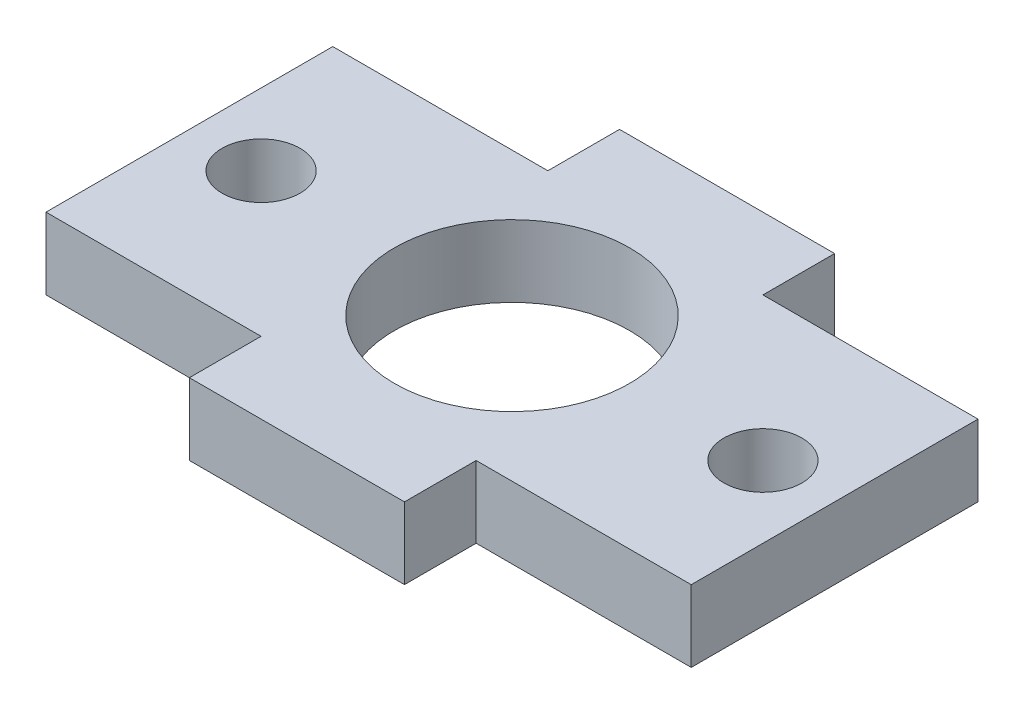
ISO-10303-21;
HEADER;
FILE_DESCRIPTION(('STEP AP214'),'2;1');
FILE_NAME('part.step','',(''),(''),'','','');
FILE_SCHEMA(('AUTOMOTIVE_DESIGN { 1 0 10303 214 1 1 1 1 }'));
ENDSEC;
DATA;
#1=APPLICATION_CONTEXT('core data for automotive mechanical design processes');
#2=APPLICATION_PROTOCOL_DEFINITION('international standard','automotive_design',2000,#1);
#3=PRODUCT_CONTEXT('',#1,'mechanical');
#4=PRODUCT('Part','Part','',(#3));
#5=PRODUCT_RELATED_PRODUCT_CATEGORY('part','',(#4));
#6=PRODUCT_DEFINITION_FORMATION('','',#4);
#7=PRODUCT_DEFINITION_CONTEXT('part definition',#1,'design');
#8=PRODUCT_DEFINITION('design','',#6,#7);
#9=PRODUCT_DEFINITION_SHAPE('','',#8);
#10=(LENGTH_UNIT() NAMED_UNIT(*) SI_UNIT(.MILLI.,.METRE.));
#11=(NAMED_UNIT(*) PLANE_ANGLE_UNIT() SI_UNIT($,.RADIAN.));
#12=(NAMED_UNIT(*) SI_UNIT($,.STERADIAN.) SOLID_ANGLE_UNIT());
#13=UNCERTAINTY_MEASURE_WITH_UNIT(LENGTH_MEASURE(1.E-05),#10,'distance_accuracy_value','');
#14=(GEOMETRIC_REPRESENTATION_CONTEXT(3) GLOBAL_UNCERTAINTY_ASSIGNED_CONTEXT((#13)) GLOBAL_UNIT_ASSIGNED_CONTEXT((#10,
#11,#12)) REPRESENTATION_CONTEXT('',''));
#15=CARTESIAN_POINT('',(0.,0.,0.));
#16=DIRECTION('',(0.,0.,1.));
#17=DIRECTION('',(1.,0.,0.));
#18=AXIS2_PLACEMENT_3D('',#15,#16,#17);
#19=CARTESIAN_POINT('',(-28.575,6.35,12.7));
#20=DIRECTION('',(0.,0.,-1.));
#21=DIRECTION('',(-1.,0.,0.));
#22=AXIS2_PLACEMENT_3D('',#19,#20,#21);
#23=PLANE('',#22);
#24=DIRECTION('',(0.,1.,0.));
#25=VECTOR('',#24,1.);
#26=CARTESIAN_POINT('',(9.525,-20.0804631420692,12.7));
#27=LINE('',#26,#25);
#28=CARTESIAN_POINT('',(9.525,0.,12.7));
#29=VERTEX_POINT('',#28);
#30=CARTESIAN_POINT('',(9.525,6.35,12.7));
#31=VERTEX_POINT('',#30);
#32=EDGE_CURVE('E161',#29,#31,#27,.T.);
#33=ORIENTED_EDGE('',*,*,#32,.F.);
#34=DIRECTION('',(1.,0.,0.));
#35=VECTOR('',#34,1.);
#36=CARTESIAN_POINT('',(-28.575,0.,12.7));
#37=LINE('',#36,#35);
#38=CARTESIAN_POINT('',(28.575,0.,12.7));
#39=VERTEX_POINT('',#38);
#40=EDGE_CURVE('E199',#29,#39,#37,.T.);
#41=ORIENTED_EDGE('',*,*,#40,.T.);
#42=DIRECTION('',(0.,-1.,0.));
#43=VECTOR('',#42,1.);
#44=CARTESIAN_POINT('',(28.575,6.35,12.7));
#45=LINE('',#44,#43);
#46=CARTESIAN_POINT('',(28.575,6.35,12.7));
#47=VERTEX_POINT('',#46);
#48=EDGE_CURVE('E181',#47,#39,#45,.T.);
#49=ORIENTED_EDGE('',*,*,#48,.F.);
#50=DIRECTION('',(1.,0.,0.));
#51=VECTOR('',#50,1.);
#52=CARTESIAN_POINT('',(-28.575,6.35,12.7));
#53=LINE('',#52,#51);
#54=EDGE_CURVE('E152',#31,#47,#53,.T.);
#55=ORIENTED_EDGE('',*,*,#54,.F.);
#56=EDGE_LOOP('',(#33,#41,#49,#55));
#57=FACE_BOUND('',#56,.T.);
#58=ADVANCED_FACE('F35',(#57),#23,.F.);
#59=CARTESIAN_POINT('',(-28.575,6.35,-12.7));
#60=DIRECTION('',(0.,0.,1.));
#61=DIRECTION('',(1.,0.,0.));
#62=AXIS2_PLACEMENT_3D('',#59,#60,#61);
#63=PLANE('',#62);
#64=DIRECTION('',(0.,1.,0.));
#65=VECTOR('',#64,1.);
#66=CARTESIAN_POINT('',(-9.525,-20.0804631420692,-12.7));
#67=LINE('',#66,#65);
#68=CARTESIAN_POINT('',(-9.525,0.,-12.7));
#69=VERTEX_POINT('',#68);
#70=CARTESIAN_POINT('',(-9.525,6.35,-12.7));
#71=VERTEX_POINT('',#70);
#72=EDGE_CURVE('E223',#69,#71,#67,.T.);
#73=ORIENTED_EDGE('',*,*,#72,.F.);
#74=DIRECTION('',(-1.,0.,0.));
#75=VECTOR('',#74,1.);
#76=CARTESIAN_POINT('',(-28.575,0.,-12.7));
#77=LINE('',#76,#75);
#78=CARTESIAN_POINT('',(-28.575,0.,-12.7));
#79=VERTEX_POINT('',#78);
#80=EDGE_CURVE('E217',#69,#79,#77,.T.);
#81=ORIENTED_EDGE('',*,*,#80,.T.);
#82=DIRECTION('',(0.,-1.,0.));
#83=VECTOR('',#82,1.);
#84=CARTESIAN_POINT('',(-28.575,6.35,-12.7));
#85=LINE('',#84,#83);
#86=CARTESIAN_POINT('',(-28.575,6.35,-12.7));
#87=VERTEX_POINT('',#86);
#88=EDGE_CURVE('E44',#87,#79,#85,.T.);
#89=ORIENTED_EDGE('',*,*,#88,.F.);
#90=DIRECTION('',(-1.,0.,0.));
#91=VECTOR('',#90,1.);
#92=CARTESIAN_POINT('',(-28.575,6.35,-12.7));
#93=LINE('',#92,#91);
#94=EDGE_CURVE('E188',#71,#87,#93,.T.);
#95=ORIENTED_EDGE('',*,*,#94,.F.);
#96=EDGE_LOOP('',(#73,#81,#89,#95));
#97=FACE_BOUND('',#96,.T.);
#98=ADVANCED_FACE('F302',(#97),#63,.F.);
#99=CARTESIAN_POINT('',(0.,6.35,0.));
#100=DIRECTION('',(0.,1.,0.));
#101=DIRECTION('',(0.,0.,1.));
#102=AXIS2_PLACEMENT_3D('',#99,#100,#101);
#103=PLANE('',#102);
#104=CARTESIAN_POINT('',(-22.225,6.35,0.));
#105=DIRECTION('',(0.,1.,0.));
#106=DIRECTION('',(0.,0.,1.));
#107=AXIS2_PLACEMENT_3D('',#104,#105,#106);
#108=CIRCLE('',#107,3.45440000000001);
#109=CARTESIAN_POINT('',(-22.225,6.35,3.45440000000001));
#110=VERTEX_POINT('',#109);
#111=EDGE_CURVE('E243',#110,#110,#108,.T.);
#112=ORIENTED_EDGE('',*,*,#111,.F.);
#113=EDGE_LOOP('',(#112));
#114=FACE_BOUND('',#113,.T.);
#115=DIRECTION('',(0.,0.,-1.));
#116=VECTOR('',#115,1.);
#117=CARTESIAN_POINT('',(28.575,6.35,-12.7));
#118=LINE('',#117,#116);
#119=CARTESIAN_POINT('',(28.575,6.35,-12.7));
#120=VERTEX_POINT('',#119);
#121=EDGE_CURVE('E222',#47,#120,#118,.T.);
#122=ORIENTED_EDGE('',*,*,#121,.T.);
#123=CARTESIAN_POINT('',(9.525,6.35,-12.7));
#124=VERTEX_POINT('',#123);
#125=EDGE_CURVE('E184',#120,#124,#93,.T.);
#126=ORIENTED_EDGE('',*,*,#125,.T.);
#127=DIRECTION('',(0.,0.,-1.));
#128=VECTOR('',#127,1.);
#129=CARTESIAN_POINT('',(9.525,6.35,-12.7));
#130=LINE('',#129,#128);
#131=CARTESIAN_POINT('',(9.525,6.35,-19.05));
#132=VERTEX_POINT('',#131);
#133=EDGE_CURVE('E265',#124,#132,#130,.T.);
#134=ORIENTED_EDGE('',*,*,#133,.T.);
#135=DIRECTION('',(-1.,0.,0.));
#136=VECTOR('',#135,1.);
#137=CARTESIAN_POINT('',(-9.525,6.35,-19.05));
#138=LINE('',#137,#136);
#139=CARTESIAN_POINT('',(-9.525,6.35,-19.05));
#140=VERTEX_POINT('',#139);
#141=EDGE_CURVE('E227',#132,#140,#138,.T.);
#142=ORIENTED_EDGE('',*,*,#141,.T.);
#143=DIRECTION('',(0.,0.,1.));
#144=VECTOR('',#143,1.);
#145=CARTESIAN_POINT('',(-9.525,6.35,-12.7));
#146=LINE('',#145,#144);
#147=EDGE_CURVE('E228',#140,#71,#146,.T.);
#148=ORIENTED_EDGE('',*,*,#147,.T.);
#149=ORIENTED_EDGE('',*,*,#94,.T.);
#150=DIRECTION('',(0.,0.,1.));
#151=VECTOR('',#150,1.);
#152=CARTESIAN_POINT('',(-28.575,6.35,-12.7));
#153=LINE('',#152,#151);
#154=CARTESIAN_POINT('',(-28.575,6.35,12.7));
#155=VERTEX_POINT('',#154);
#156=EDGE_CURVE('E183',#87,#155,#153,.T.);
#157=ORIENTED_EDGE('',*,*,#156,.T.);
#158=CARTESIAN_POINT('',(-9.525,6.35,12.7));
#159=VERTEX_POINT('',#158);
#160=EDGE_CURVE('E148',#155,#159,#53,.T.);
#161=ORIENTED_EDGE('',*,*,#160,.T.);
#162=DIRECTION('',(0.,0.,-1.));
#163=VECTOR('',#162,1.);
#164=CARTESIAN_POINT('',(-9.525,6.35,12.7));
#165=LINE('',#164,#163);
#166=CARTESIAN_POINT('',(-9.525,6.35,19.05));
#167=VERTEX_POINT('',#166);
#168=EDGE_CURVE('E52',#167,#159,#165,.T.);
#169=ORIENTED_EDGE('',*,*,#168,.F.);
#170=DIRECTION('',(-1.,0.,0.));
#171=VECTOR('',#170,1.);
#172=CARTESIAN_POINT('',(-9.525,6.35,19.05));
#173=LINE('',#172,#171);
#174=CARTESIAN_POINT('',(9.525,6.35,19.05));
#175=VERTEX_POINT('',#174);
#176=EDGE_CURVE('E136',#175,#167,#173,.T.);
#177=ORIENTED_EDGE('',*,*,#176,.F.);
#178=DIRECTION('',(0.,0.,1.));
#179=VECTOR('',#178,1.);
#180=CARTESIAN_POINT('',(9.525,6.35,12.7));
#181=LINE('',#180,#179);
#182=EDGE_CURVE('E133',#31,#175,#181,.T.);
#183=ORIENTED_EDGE('',*,*,#182,.F.);
#184=ORIENTED_EDGE('',*,*,#54,.T.);
#185=EDGE_LOOP('',(#122,#126,#134,#142,#148,#149,#157,#161,#169,#177,#183,#184));
#186=FACE_BOUND('',#185,.T.);
#187=CARTESIAN_POINT('',(0.,6.35,0.));
#188=DIRECTION('',(0.,1.,0.));
#189=DIRECTION('',(0.,0.,1.));
#190=AXIS2_PLACEMENT_3D('',#187,#188,#189);
#191=CIRCLE('',#190,10.414);
#192=CARTESIAN_POINT('',(0.,6.35,10.414));
#193=VERTEX_POINT('',#192);
#194=EDGE_CURVE('E249',#193,#193,#191,.T.);
#195=ORIENTED_EDGE('',*,*,#194,.F.);
#196=EDGE_LOOP('',(#195));
#197=FACE_BOUND('',#196,.T.);
#198=CARTESIAN_POINT('',(22.225,6.35,0.));
#199=DIRECTION('',(0.,1.,0.));
#200=DIRECTION('',(0.,0.,1.));
#201=AXIS2_PLACEMENT_3D('',#198,#199,#200);
#202=CIRCLE('',#201,3.45440000000001);
#203=CARTESIAN_POINT('',(22.225,6.35,3.4544));
#204=VERTEX_POINT('',#203);
#205=EDGE_CURVE('E235',#204,#204,#202,.T.);
#206=ORIENTED_EDGE('',*,*,#205,.F.);
#207=EDGE_LOOP('',(#206));
#208=FACE_BOUND('',#207,.T.);
#209=ADVANCED_FACE('F145',(#114,#186,#197,#208),#103,.T.);
#210=CARTESIAN_POINT('',(0.,0.,0.));
#211=DIRECTION('',(0.,1.,0.));
#212=DIRECTION('',(0.,0.,1.));
#213=AXIS2_PLACEMENT_3D('',#210,#211,#212);
#214=PLANE('',#213);
#215=CARTESIAN_POINT('',(-22.225,0.,0.));
#216=DIRECTION('',(0.,1.,0.));
#217=DIRECTION('',(0.,0.,1.));
#218=AXIS2_PLACEMENT_3D('',#215,#216,#217);
#219=CIRCLE('',#218,3.45440000000001);
#220=CARTESIAN_POINT('',(-22.225,0.,3.45440000000001));
#221=VERTEX_POINT('',#220);
#222=EDGE_CURVE('E238',#221,#221,#219,.T.);
#223=ORIENTED_EDGE('',*,*,#222,.T.);
#224=EDGE_LOOP('',(#223));
#225=FACE_BOUND('',#224,.T.);
#226=DIRECTION('',(0.,0.,-1.));
#227=VECTOR('',#226,1.);
#228=CARTESIAN_POINT('',(28.575,0.,-12.7));
#229=LINE('',#228,#227);
#230=CARTESIAN_POINT('',(28.575,0.,-12.7));
#231=VERTEX_POINT('',#230);
#232=EDGE_CURVE('E195',#39,#231,#229,.T.);
#233=ORIENTED_EDGE('',*,*,#232,.F.);
#234=ORIENTED_EDGE('',*,*,#40,.F.);
#235=DIRECTION('',(0.,0.,-1.));
#236=VECTOR('',#235,1.);
#237=CARTESIAN_POINT('',(9.525,0.,12.7));
#238=LINE('',#237,#236);
#239=CARTESIAN_POINT('',(9.525,0.,19.05));
#240=VERTEX_POINT('',#239);
#241=EDGE_CURVE('E170',#240,#29,#238,.T.);
#242=ORIENTED_EDGE('',*,*,#241,.F.);
#243=DIRECTION('',(1.,0.,0.));
#244=VECTOR('',#243,1.);
#245=CARTESIAN_POINT('',(-9.525,0.,19.05));
#246=LINE('',#245,#244);
#247=CARTESIAN_POINT('',(-9.525,0.,19.05));
#248=VERTEX_POINT('',#247);
#249=EDGE_CURVE('E160',#248,#240,#246,.T.);
#250=ORIENTED_EDGE('',*,*,#249,.F.);
#251=DIRECTION('',(0.,0.,1.));
#252=VECTOR('',#251,1.);
#253=CARTESIAN_POINT('',(-9.525,0.,12.7));
#254=LINE('',#253,#252);
#255=CARTESIAN_POINT('',(-9.525,0.,12.7));
#256=VERTEX_POINT('',#255);
#257=EDGE_CURVE('E129',#256,#248,#254,.T.);
#258=ORIENTED_EDGE('',*,*,#257,.F.);
#259=CARTESIAN_POINT('',(-28.575,0.,12.7));
#260=VERTEX_POINT('',#259);
#261=EDGE_CURVE('E202',#260,#256,#37,.T.);
#262=ORIENTED_EDGE('',*,*,#261,.F.);
#263=DIRECTION('',(0.,0.,1.));
#264=VECTOR('',#263,1.);
#265=CARTESIAN_POINT('',(-28.575,0.,-12.7));
#266=LINE('',#265,#264);
#267=EDGE_CURVE('E203',#79,#260,#266,.T.);
#268=ORIENTED_EDGE('',*,*,#267,.F.);
#269=ORIENTED_EDGE('',*,*,#80,.F.);
#270=DIRECTION('',(0.,0.,-1.));
#271=VECTOR('',#270,1.);
#272=CARTESIAN_POINT('',(-9.525,0.,-12.7));
#273=LINE('',#272,#271);
#274=CARTESIAN_POINT('',(-9.525,0.,-19.05));
#275=VERTEX_POINT('',#274);
#276=EDGE_CURVE('E242',#69,#275,#273,.T.);
#277=ORIENTED_EDGE('',*,*,#276,.T.);
#278=DIRECTION('',(1.,0.,0.));
#279=VECTOR('',#278,1.);
#280=CARTESIAN_POINT('',(-9.525,0.,-19.05));
#281=LINE('',#280,#279);
#282=CARTESIAN_POINT('',(9.525,0.,-19.05));
#283=VERTEX_POINT('',#282);
#284=EDGE_CURVE('E282',#275,#283,#281,.T.);
#285=ORIENTED_EDGE('',*,*,#284,.T.);
#286=DIRECTION('',(0.,0.,1.));
#287=VECTOR('',#286,1.);
#288=CARTESIAN_POINT('',(9.525,0.,-12.7));
#289=LINE('',#288,#287);
#290=CARTESIAN_POINT('',(9.525,0.,-12.7));
#291=VERTEX_POINT('',#290);
#292=EDGE_CURVE('E279',#283,#291,#289,.T.);
#293=ORIENTED_EDGE('',*,*,#292,.T.);
#294=EDGE_CURVE('E215',#231,#291,#77,.T.);
#295=ORIENTED_EDGE('',*,*,#294,.F.);
#296=EDGE_LOOP('',(#233,#234,#242,#250,#258,#262,#268,#269,#277,#285,#293,#295));
#297=FACE_BOUND('',#296,.T.);
#298=CARTESIAN_POINT('',(0.,0.,0.));
#299=DIRECTION('',(0.,1.,0.));
#300=DIRECTION('',(0.,0.,1.));
#301=AXIS2_PLACEMENT_3D('',#298,#299,#300);
#302=CIRCLE('',#301,10.414);
#303=CARTESIAN_POINT('',(0.,0.,10.414));
#304=VERTEX_POINT('',#303);
#305=EDGE_CURVE('E246',#304,#304,#302,.T.);
#306=ORIENTED_EDGE('',*,*,#305,.T.);
#307=EDGE_LOOP('',(#306));
#308=FACE_BOUND('',#307,.T.);
#309=CARTESIAN_POINT('',(22.225,0.,0.));
#310=DIRECTION('',(0.,1.,0.));
#311=DIRECTION('',(0.,0.,1.));
#312=AXIS2_PLACEMENT_3D('',#309,#310,#311);
#313=CIRCLE('',#312,3.45440000000001);
#314=CARTESIAN_POINT('',(22.225,0.,3.4544));
#315=VERTEX_POINT('',#314);
#316=EDGE_CURVE('E239',#315,#315,#313,.T.);
#317=ORIENTED_EDGE('',*,*,#316,.T.);
#318=EDGE_LOOP('',(#317));
#319=FACE_BOUND('',#318,.T.);
#320=ADVANCED_FACE('F261',(#225,#297,#308,#319),#214,.F.);
#321=CARTESIAN_POINT('',(28.575,6.35,-12.7));
#322=DIRECTION('',(-1.,0.,0.));
#323=DIRECTION('',(0.,0.,1.));
#324=AXIS2_PLACEMENT_3D('',#321,#322,#323);
#325=PLANE('',#324);
#326=ORIENTED_EDGE('',*,*,#232,.T.);
#327=DIRECTION('',(0.,-1.,0.));
#328=VECTOR('',#327,1.);
#329=CARTESIAN_POINT('',(28.575,6.35,-12.7));
#330=LINE('',#329,#328);
#331=EDGE_CURVE('E11',#120,#231,#330,.T.);
#332=ORIENTED_EDGE('',*,*,#331,.F.);
#333=ORIENTED_EDGE('',*,*,#121,.F.);
#334=ORIENTED_EDGE('',*,*,#48,.T.);
#335=EDGE_LOOP('',(#326,#332,#333,#334));
#336=FACE_BOUND('',#335,.T.);
#337=ADVANCED_FACE('F37',(#336),#325,.F.);
#338=ORIENTED_EDGE('',*,*,#294,.T.);
#339=DIRECTION('',(0.,1.,0.));
#340=VECTOR('',#339,1.);
#341=CARTESIAN_POINT('',(9.525,-20.0804631420692,-12.7));
#342=LINE('',#341,#340);
#343=EDGE_CURVE('E60',#291,#124,#342,.T.);
#344=ORIENTED_EDGE('',*,*,#343,.T.);
#345=ORIENTED_EDGE('',*,*,#125,.F.);
#346=ORIENTED_EDGE('',*,*,#331,.T.);
#347=EDGE_LOOP('',(#338,#344,#345,#346));
#348=FACE_BOUND('',#347,.T.);
#349=ADVANCED_FACE('F307',(#348),#63,.F.);
#350=CARTESIAN_POINT('',(-28.575,6.35,-12.7));
#351=DIRECTION('',(1.,0.,0.));
#352=DIRECTION('',(0.,0.,-1.));
#353=AXIS2_PLACEMENT_3D('',#350,#351,#352);
#354=PLANE('',#353);
#355=ORIENTED_EDGE('',*,*,#267,.T.);
#356=DIRECTION('',(0.,-1.,0.));
#357=VECTOR('',#356,1.);
#358=CARTESIAN_POINT('',(-28.575,6.35,12.7));
#359=LINE('',#358,#357);
#360=EDGE_CURVE('E210',#155,#260,#359,.T.);
#361=ORIENTED_EDGE('',*,*,#360,.F.);
#362=ORIENTED_EDGE('',*,*,#156,.F.);
#363=ORIENTED_EDGE('',*,*,#88,.T.);
#364=EDGE_LOOP('',(#355,#361,#362,#363));
#365=FACE_BOUND('',#364,.T.);
#366=ADVANCED_FACE('F305',(#365),#354,.F.);
#367=ORIENTED_EDGE('',*,*,#261,.T.);
#368=DIRECTION('',(0.,1.,0.));
#369=VECTOR('',#368,1.);
#370=CARTESIAN_POINT('',(-9.525,-20.0804631420692,12.7));
#371=LINE('',#370,#369);
#372=EDGE_CURVE('E157',#256,#159,#371,.T.);
#373=ORIENTED_EDGE('',*,*,#372,.T.);
#374=ORIENTED_EDGE('',*,*,#160,.F.);
#375=ORIENTED_EDGE('',*,*,#360,.T.);
#376=EDGE_LOOP('',(#367,#373,#374,#375));
#377=FACE_BOUND('',#376,.T.);
#378=ADVANCED_FACE('F257',(#377),#23,.F.);
#379=CARTESIAN_POINT('',(0.,6.35,0.));
#380=DIRECTION('',(0.,-1.,0.));
#381=DIRECTION('',(0.,0.,-1.));
#382=AXIS2_PLACEMENT_3D('',#379,#380,#381);
#383=CYLINDRICAL_SURFACE('',#382,10.414);
#384=ORIENTED_EDGE('',*,*,#194,.T.);
#385=EDGE_LOOP('',(#384));
#386=FACE_BOUND('',#385,.T.);
#387=ORIENTED_EDGE('',*,*,#305,.F.);
#388=EDGE_LOOP('',(#387));
#389=FACE_BOUND('',#388,.T.);
#390=ADVANCED_FACE('F313',(#386,#389),#383,.F.);
#391=CARTESIAN_POINT('',(-22.225,6.35,0.));
#392=DIRECTION('',(0.,-1.,0.));
#393=DIRECTION('',(0.,0.,-1.));
#394=AXIS2_PLACEMENT_3D('',#391,#392,#393);
#395=CYLINDRICAL_SURFACE('',#394,3.45440000000001);
#396=ORIENTED_EDGE('',*,*,#111,.T.);
#397=EDGE_LOOP('',(#396));
#398=FACE_BOUND('',#397,.T.);
#399=ORIENTED_EDGE('',*,*,#222,.F.);
#400=EDGE_LOOP('',(#399));
#401=FACE_BOUND('',#400,.T.);
#402=ADVANCED_FACE('F328',(#398,#401),#395,.F.);
#403=CARTESIAN_POINT('',(22.225,6.35,0.));
#404=DIRECTION('',(0.,-1.,0.));
#405=DIRECTION('',(0.,0.,-1.));
#406=AXIS2_PLACEMENT_3D('',#403,#404,#405);
#407=CYLINDRICAL_SURFACE('',#406,3.45440000000001);
#408=ORIENTED_EDGE('',*,*,#205,.T.);
#409=EDGE_LOOP('',(#408));
#410=FACE_BOUND('',#409,.T.);
#411=ORIENTED_EDGE('',*,*,#316,.F.);
#412=EDGE_LOOP('',(#411));
#413=FACE_BOUND('',#412,.T.);
#414=ADVANCED_FACE('F332',(#410,#413),#407,.F.);
#415=CARTESIAN_POINT('',(-9.525,-20.0804631420692,-12.7));
#416=DIRECTION('',(-1.,0.,0.));
#417=DIRECTION('',(0.,0.,1.));
#418=AXIS2_PLACEMENT_3D('',#415,#416,#417);
#419=PLANE('',#418);
#420=ORIENTED_EDGE('',*,*,#276,.F.);
#421=ORIENTED_EDGE('',*,*,#72,.T.);
#422=ORIENTED_EDGE('',*,*,#147,.F.);
#423=DIRECTION('',(0.,1.,0.));
#424=VECTOR('',#423,1.);
#425=CARTESIAN_POINT('',(-9.525,-20.0804631420692,-19.05));
#426=LINE('',#425,#424);
#427=EDGE_CURVE('E283',#275,#140,#426,.T.);
#428=ORIENTED_EDGE('',*,*,#427,.F.);
#429=EDGE_LOOP('',(#420,#421,#422,#428));
#430=FACE_BOUND('',#429,.T.);
#431=ADVANCED_FACE('F300',(#430),#419,.T.);
#432=CARTESIAN_POINT('',(-9.525,-20.0804631420692,-19.05));
#433=DIRECTION('',(0.,0.,-1.));
#434=DIRECTION('',(-1.,0.,0.));
#435=AXIS2_PLACEMENT_3D('',#432,#433,#434);
#436=PLANE('',#435);
#437=ORIENTED_EDGE('',*,*,#284,.F.);
#438=ORIENTED_EDGE('',*,*,#427,.T.);
#439=ORIENTED_EDGE('',*,*,#141,.F.);
#440=DIRECTION('',(0.,1.,0.));
#441=VECTOR('',#440,1.);
#442=CARTESIAN_POINT('',(9.525,-20.0804631420692,-19.05));
#443=LINE('',#442,#441);
#444=EDGE_CURVE('E276',#283,#132,#443,.T.);
#445=ORIENTED_EDGE('',*,*,#444,.F.);
#446=EDGE_LOOP('',(#437,#438,#439,#445));
#447=FACE_BOUND('',#446,.T.);
#448=ADVANCED_FACE('F297',(#447),#436,.T.);
#449=CARTESIAN_POINT('',(9.525,-20.0804631420692,-12.7));
#450=DIRECTION('',(1.,0.,0.));
#451=DIRECTION('',(0.,0.,-1.));
#452=AXIS2_PLACEMENT_3D('',#449,#450,#451);
#453=PLANE('',#452);
#454=ORIENTED_EDGE('',*,*,#292,.F.);
#455=ORIENTED_EDGE('',*,*,#444,.T.);
#456=ORIENTED_EDGE('',*,*,#133,.F.);
#457=ORIENTED_EDGE('',*,*,#343,.F.);
#458=EDGE_LOOP('',(#454,#455,#456,#457));
#459=FACE_BOUND('',#458,.T.);
#460=ADVANCED_FACE('F295',(#459),#453,.T.);
#461=CARTESIAN_POINT('',(-9.525,-20.0804631420692,19.05));
#462=DIRECTION('',(0.,0.,-1.));
#463=DIRECTION('',(-1.,0.,0.));
#464=AXIS2_PLACEMENT_3D('',#461,#462,#463);
#465=PLANE('',#464);
#466=DIRECTION('',(0.,1.,0.));
#467=VECTOR('',#466,1.);
#468=CARTESIAN_POINT('',(-9.525,-20.0804631420692,19.05));
#469=LINE('',#468,#467);
#470=EDGE_CURVE('E126',#248,#167,#469,.T.);
#471=ORIENTED_EDGE('',*,*,#470,.F.);
#472=ORIENTED_EDGE('',*,*,#249,.T.);
#473=DIRECTION('',(0.,1.,0.));
#474=VECTOR('',#473,1.);
#475=CARTESIAN_POINT('',(9.525,-20.0804631420692,19.05));
#476=LINE('',#475,#474);
#477=EDGE_CURVE('E132',#240,#175,#476,.T.);
#478=ORIENTED_EDGE('',*,*,#477,.T.);
#479=ORIENTED_EDGE('',*,*,#176,.T.);
#480=EDGE_LOOP('',(#471,#472,#478,#479));
#481=FACE_BOUND('',#480,.T.);
#482=ADVANCED_FACE('F137',(#481),#465,.F.);
#483=CARTESIAN_POINT('',(9.525,-20.0804631420692,12.7));
#484=DIRECTION('',(-1.,0.,0.));
#485=DIRECTION('',(0.,0.,1.));
#486=AXIS2_PLACEMENT_3D('',#483,#484,#485);
#487=PLANE('',#486);
#488=ORIENTED_EDGE('',*,*,#477,.F.);
#489=ORIENTED_EDGE('',*,*,#241,.T.);
#490=ORIENTED_EDGE('',*,*,#32,.T.);
#491=ORIENTED_EDGE('',*,*,#182,.T.);
#492=EDGE_LOOP('',(#488,#489,#490,#491));
#493=FACE_BOUND('',#492,.T.);
#494=ADVANCED_FACE('F174',(#493),#487,.F.);
#495=CARTESIAN_POINT('',(-9.525,-20.0804631420692,12.7));
#496=DIRECTION('',(1.,0.,0.));
#497=DIRECTION('',(0.,0.,-1.));
#498=AXIS2_PLACEMENT_3D('',#495,#496,#497);
#499=PLANE('',#498);
#500=ORIENTED_EDGE('',*,*,#372,.F.);
#501=ORIENTED_EDGE('',*,*,#257,.T.);
#502=ORIENTED_EDGE('',*,*,#470,.T.);
#503=ORIENTED_EDGE('',*,*,#168,.T.);
#504=EDGE_LOOP('',(#500,#501,#502,#503));
#505=FACE_BOUND('',#504,.T.);
#506=ADVANCED_FACE('F128',(#505),#499,.F.);
#507=CLOSED_SHELL('',(#58,#98,#209,#320,#337,#349,#366,#378,#390,#402,#414,#431,#448,#460,#482,
#494,#506));
#508=MANIFOLD_SOLID_BREP('B2',#507);
#509=ADVANCED_BREP_SHAPE_REPRESENTATION('',(#18,#508),#14);
#510=SHAPE_DEFINITION_REPRESENTATION(#9,#509);
ENDSEC;
END-ISO-10303-21;
